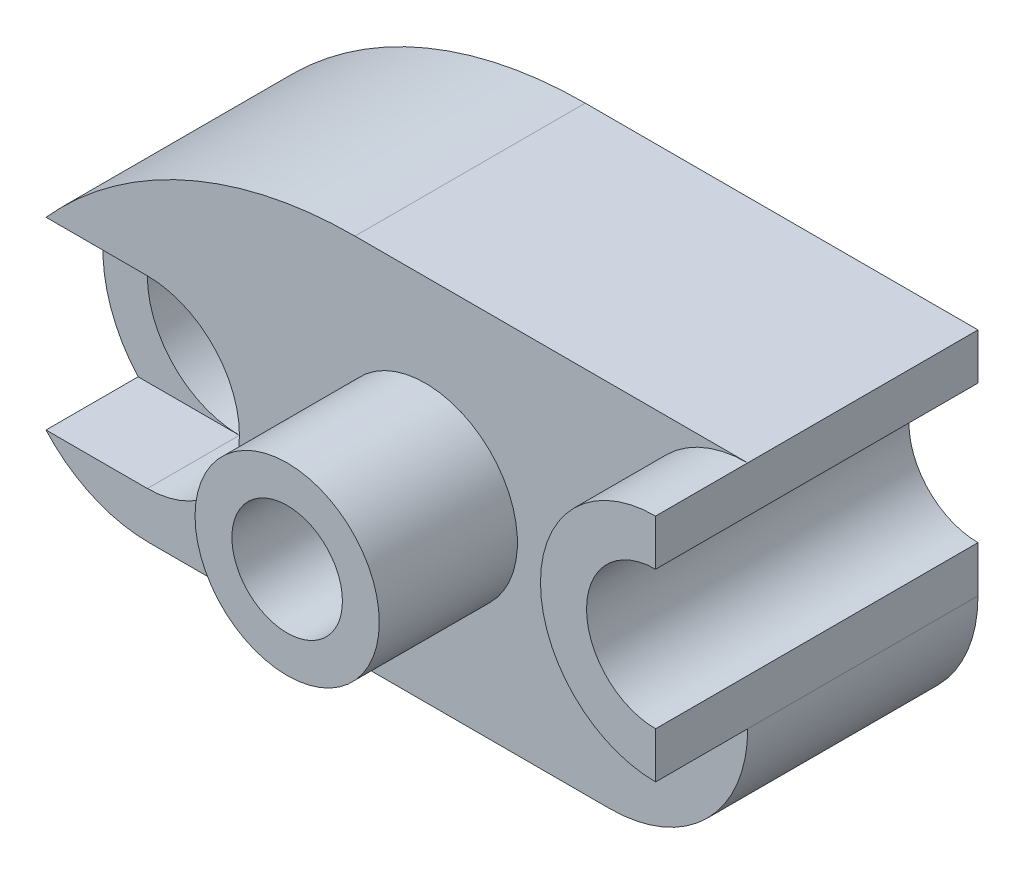
ISO-10303-21;
HEADER;
FILE_DESCRIPTION(('STEP AP214'),'2;1');
FILE_NAME('part.step','',(''),(''),'','','');
FILE_SCHEMA(('AUTOMOTIVE_DESIGN { 1 0 10303 214 1 1 1 1 }'));
ENDSEC;
DATA;
#1=APPLICATION_CONTEXT('core data for automotive mechanical design processes');
#2=APPLICATION_PROTOCOL_DEFINITION('international standard','automotive_design',2000,#1);
#3=PRODUCT_CONTEXT('',#1,'mechanical');
#4=PRODUCT('Part','Part','',(#3));
#5=PRODUCT_RELATED_PRODUCT_CATEGORY('part','',(#4));
#6=PRODUCT_DEFINITION_FORMATION('','',#4);
#7=PRODUCT_DEFINITION_CONTEXT('part definition',#1,'design');
#8=PRODUCT_DEFINITION('design','',#6,#7);
#9=PRODUCT_DEFINITION_SHAPE('','',#8);
#10=(LENGTH_UNIT() NAMED_UNIT(*) SI_UNIT(.MILLI.,.METRE.));
#11=(NAMED_UNIT(*) PLANE_ANGLE_UNIT() SI_UNIT($,.RADIAN.));
#12=(NAMED_UNIT(*) SI_UNIT($,.STERADIAN.) SOLID_ANGLE_UNIT());
#13=UNCERTAINTY_MEASURE_WITH_UNIT(LENGTH_MEASURE(1.E-05),#10,'distance_accuracy_value','');
#14=(GEOMETRIC_REPRESENTATION_CONTEXT(3) GLOBAL_UNCERTAINTY_ASSIGNED_CONTEXT((#13)) GLOBAL_UNIT_ASSIGNED_CONTEXT((#10,
#11,#12)) REPRESENTATION_CONTEXT('',''));
#15=CARTESIAN_POINT('',(0.,0.,0.));
#16=DIRECTION('',(0.,0.,1.));
#17=DIRECTION('',(1.,0.,0.));
#18=AXIS2_PLACEMENT_3D('',#15,#16,#17);
#19=CARTESIAN_POINT('',(0.,0.,60.));
#20=DIRECTION('',(0.,0.,-1.));
#21=DIRECTION('',(-1.,0.,0.));
#22=AXIS2_PLACEMENT_3D('',#19,#20,#21);
#23=PLANE('',#22);
#24=CARTESIAN_POINT('',(90.,40.,60.));
#25=DIRECTION('',(0.,0.,-1.));
#26=DIRECTION('',(-1.,0.,0.));
#27=AXIS2_PLACEMENT_3D('',#24,#25,#26);
#28=CIRCLE('',#27,20.);
#29=CARTESIAN_POINT('',(70.,40.,60.));
#30=VERTEX_POINT('',#29);
#31=EDGE_CURVE('E12',#30,#30,#28,.F.);
#32=ORIENTED_EDGE('',*,*,#31,.F.);
#33=EDGE_LOOP('',(#32));
#34=FACE_BOUND('',#33,.T.);
#35=DIRECTION('',(-1.,0.,0.));
#36=VECTOR('',#35,1.);
#37=CARTESIAN_POINT('',(0.,50.,60.));
#38=LINE('',#37,#36);
#39=CARTESIAN_POINT('',(29.6393202250021,50.,60.));
#40=VERTEX_POINT('',#39);
#41=CARTESIAN_POINT('',(7.63932022500212,50.,60.));
#42=VERTEX_POINT('',#41);
#43=EDGE_CURVE('E177',#40,#42,#38,.T.);
#44=ORIENTED_EDGE('',*,*,#43,.F.);
#45=CARTESIAN_POINT('',(29.6393202250021,30.,60.));
#46=DIRECTION('',(0.,0.,1.));
#47=DIRECTION('',(1.,0.,0.));
#48=AXIS2_PLACEMENT_3D('',#45,#46,#47);
#49=CIRCLE('',#48,20.);
#50=CARTESIAN_POINT('',(29.6393202250021,10.,60.));
#51=VERTEX_POINT('',#50);
#52=EDGE_CURVE('E160',#51,#40,#49,.T.);
#53=ORIENTED_EDGE('',*,*,#52,.F.);
#54=DIRECTION('',(-1.,0.,0.));
#55=VECTOR('',#54,1.);
#56=CARTESIAN_POINT('',(0.,10.,60.));
#57=LINE('',#56,#55);
#58=CARTESIAN_POINT('',(7.6393202250021,10.,60.));
#59=VERTEX_POINT('',#58);
#60=EDGE_CURVE('E184',#51,#59,#57,.T.);
#61=ORIENTED_EDGE('',*,*,#60,.T.);
#62=CARTESIAN_POINT('',(30.,30.,60.));
#63=DIRECTION('',(0.,0.,-1.));
#64=DIRECTION('',(-1.,0.,0.));
#65=AXIS2_PLACEMENT_3D('',#62,#63,#64);
#66=CIRCLE('',#65,30.);
#67=CARTESIAN_POINT('',(30.,0.,60.));
#68=VERTEX_POINT('',#67);
#69=EDGE_CURVE('E223',#68,#59,#66,.T.);
#70=ORIENTED_EDGE('',*,*,#69,.F.);
#71=DIRECTION('',(1.,0.,0.));
#72=VECTOR('',#71,1.);
#73=CARTESIAN_POINT('',(160.,0.,60.));
#74=LINE('',#73,#72);
#75=CARTESIAN_POINT('',(130.,0.,60.));
#76=VERTEX_POINT('',#75);
#77=EDGE_CURVE('E221',#68,#76,#74,.T.);
#78=ORIENTED_EDGE('',*,*,#77,.T.);
#79=CARTESIAN_POINT('',(130.,30.,60.));
#80=DIRECTION('',(0.,0.,-1.));
#81=DIRECTION('',(-1.,0.,0.));
#82=AXIS2_PLACEMENT_3D('',#79,#80,#81);
#83=CIRCLE('',#82,30.);
#84=CARTESIAN_POINT('',(160.,30.,60.));
#85=VERTEX_POINT('',#84);
#86=EDGE_CURVE('E226',#85,#76,#83,.T.);
#87=ORIENTED_EDGE('',*,*,#86,.F.);
#88=CARTESIAN_POINT('',(160.,55.,60.));
#89=DIRECTION('',(0.,0.,1.));
#90=DIRECTION('',(1.,0.,0.));
#91=AXIS2_PLACEMENT_3D('',#88,#89,#90);
#92=CIRCLE('',#91,25.);
#93=CARTESIAN_POINT('',(160.,80.,60.));
#94=VERTEX_POINT('',#93);
#95=EDGE_CURVE('E194',#94,#85,#92,.T.);
#96=ORIENTED_EDGE('',*,*,#95,.F.);
#97=DIRECTION('',(-1.,0.,0.));
#98=VECTOR('',#97,1.);
#99=CARTESIAN_POINT('',(160.,80.,60.));
#100=LINE('',#99,#98);
#101=CARTESIAN_POINT('',(74.7213595499958,80.,60.));
#102=VERTEX_POINT('',#101);
#103=EDGE_CURVE('E81',#94,#102,#100,.T.);
#104=ORIENTED_EDGE('',*,*,#103,.T.);
#105=CARTESIAN_POINT('',(74.7213595499958,-10.,60.));
#106=DIRECTION('',(0.,0.,-1.));
#107=DIRECTION('',(-1.,0.,0.));
#108=AXIS2_PLACEMENT_3D('',#105,#106,#107);
#109=CIRCLE('',#108,90.);
#110=EDGE_CURVE('E74',#42,#102,#109,.T.);
#111=ORIENTED_EDGE('',*,*,#110,.F.);
#112=EDGE_LOOP('',(#44,#53,#61,#70,#78,#87,#96,#104,#111));
#113=FACE_BOUND('',#112,.T.);
#114=ADVANCED_FACE('F66',(#34,#113),#23,.F.);
#115=CARTESIAN_POINT('',(30.,30.,0.));
#116=DIRECTION('',(0.,0.,1.));
#117=DIRECTION('',(1.,0.,0.));
#118=AXIS2_PLACEMENT_3D('',#115,#116,#117);
#119=CYLINDRICAL_SURFACE('',#118,30.);
#120=DIRECTION('',(0.,0.,1.));
#121=VECTOR('',#120,1.);
#122=CARTESIAN_POINT('',(7.6393202250021,10.,40.));
#123=LINE('',#122,#121);
#124=CARTESIAN_POINT('',(7.6393202250021,10.,40.));
#125=VERTEX_POINT('',#124);
#126=EDGE_CURVE('E195',#125,#59,#123,.T.);
#127=ORIENTED_EDGE('',*,*,#126,.F.);
#128=CARTESIAN_POINT('',(30.,30.,40.));
#129=DIRECTION('',(0.,0.,1.));
#130=DIRECTION('',(1.,0.,0.));
#131=AXIS2_PLACEMENT_3D('',#128,#129,#130);
#132=CIRCLE('',#131,30.);
#133=CARTESIAN_POINT('',(7.63932022500211,50.,40.));
#134=VERTEX_POINT('',#133);
#135=EDGE_CURVE('E310',#134,#125,#132,.T.);
#136=ORIENTED_EDGE('',*,*,#135,.F.);
#137=DIRECTION('',(0.,0.,1.));
#138=VECTOR('',#137,1.);
#139=CARTESIAN_POINT('',(7.63932022500212,50.,-173.));
#140=LINE('',#139,#138);
#141=CARTESIAN_POINT('',(7.63932022500212,50.,9.99999999999987));
#142=VERTEX_POINT('',#141);
#143=EDGE_CURVE('E229',#142,#134,#140,.T.);
#144=ORIENTED_EDGE('',*,*,#143,.F.);
#145=CARTESIAN_POINT('',(30.,30.,10.));
#146=DIRECTION('',(0.,0.,-1.));
#147=DIRECTION('',(-1.,0.,0.));
#148=AXIS2_PLACEMENT_3D('',#145,#146,#147);
#149=CIRCLE('',#148,30.);
#150=CARTESIAN_POINT('',(30.,0.,10.));
#151=VERTEX_POINT('',#150);
#152=EDGE_CURVE('E270',#151,#142,#149,.T.);
#153=ORIENTED_EDGE('',*,*,#152,.F.);
#154=DIRECTION('',(0.,0.,1.));
#155=VECTOR('',#154,1.);
#156=CARTESIAN_POINT('',(30.,0.,0.));
#157=LINE('',#156,#155);
#158=EDGE_CURVE('E252',#151,#68,#157,.T.);
#159=ORIENTED_EDGE('',*,*,#158,.T.);
#160=ORIENTED_EDGE('',*,*,#69,.T.);
#161=EDGE_LOOP('',(#127,#136,#144,#153,#159,#160));
#162=FACE_BOUND('',#161,.T.);
#163=ADVANCED_FACE('F306',(#162),#119,.T.);
#164=CARTESIAN_POINT('',(0.,80.,90.));
#165=DIRECTION('',(0.,-1.,0.));
#166=DIRECTION('',(0.,0.,-1.));
#167=AXIS2_PLACEMENT_3D('',#164,#165,#166);
#168=PLANE('',#167);
#169=DIRECTION('',(0.,0.,1.));
#170=VECTOR('',#169,1.);
#171=CARTESIAN_POINT('',(74.7213595499958,80.,-173.));
#172=LINE('',#171,#170);
#173=CARTESIAN_POINT('',(74.7213595499958,80.,10.));
#174=VERTEX_POINT('',#173);
#175=EDGE_CURVE('E88',#174,#102,#172,.T.);
#176=ORIENTED_EDGE('',*,*,#175,.T.);
#177=ORIENTED_EDGE('',*,*,#103,.F.);
#178=DIRECTION('',(0.,0.,-1.));
#179=VECTOR('',#178,1.);
#180=CARTESIAN_POINT('',(160.,80.,90.));
#181=LINE('',#180,#179);
#182=CARTESIAN_POINT('',(160.,80.,10.));
#183=VERTEX_POINT('',#182);
#184=EDGE_CURVE('E264',#94,#183,#181,.T.);
#185=ORIENTED_EDGE('',*,*,#184,.T.);
#186=DIRECTION('',(-1.,0.,0.));
#187=VECTOR('',#186,1.);
#188=CARTESIAN_POINT('',(215.,80.,10.));
#189=LINE('',#188,#187);
#190=EDGE_CURVE('E246',#183,#174,#189,.T.);
#191=ORIENTED_EDGE('',*,*,#190,.T.);
#192=EDGE_LOOP('',(#176,#177,#185,#191));
#193=FACE_BOUND('',#192,.T.);
#194=ADVANCED_FACE('F275',(#193),#168,.F.);
#195=CARTESIAN_POINT('',(0.,0.,0.));
#196=DIRECTION('',(0.,0.,-1.));
#197=DIRECTION('',(-1.,0.,0.));
#198=AXIS2_PLACEMENT_3D('',#195,#196,#197);
#199=PLANE('',#198);
#200=CARTESIAN_POINT('',(90.,40.,0.));
#201=DIRECTION('',(0.,0.,-1.));
#202=DIRECTION('',(-1.,0.,0.));
#203=AXIS2_PLACEMENT_3D('',#200,#201,#202);
#204=CIRCLE('',#203,12.);
#205=CARTESIAN_POINT('',(78.,40.,0.));
#206=VERTEX_POINT('',#205);
#207=EDGE_CURVE('E321',#206,#206,#204,.T.);
#208=ORIENTED_EDGE('',*,*,#207,.F.);
#209=EDGE_LOOP('',(#208));
#210=FACE_BOUND('',#209,.T.);
#211=CARTESIAN_POINT('',(90.,40.,0.));
#212=DIRECTION('',(0.,0.,-1.));
#213=DIRECTION('',(-1.,0.,0.));
#214=AXIS2_PLACEMENT_3D('',#211,#212,#213);
#215=CIRCLE('',#214,25.);
#216=CARTESIAN_POINT('',(65.,40.,0.));
#217=VERTEX_POINT('',#216);
#218=EDGE_CURVE('E231',#217,#217,#215,.T.);
#219=ORIENTED_EDGE('',*,*,#218,.T.);
#220=EDGE_LOOP('',(#219));
#221=FACE_BOUND('',#220,.T.);
#222=ADVANCED_FACE('F361',(#210,#221),#199,.T.);
#223=CARTESIAN_POINT('',(130.,30.,0.));
#224=DIRECTION('',(0.,0.,1.));
#225=DIRECTION('',(1.,0.,0.));
#226=AXIS2_PLACEMENT_3D('',#223,#224,#225);
#227=CYLINDRICAL_SURFACE('',#226,30.);
#228=DIRECTION('',(0.,0.,1.));
#229=VECTOR('',#228,1.);
#230=CARTESIAN_POINT('',(160.,30.,0.));
#231=LINE('',#230,#229);
#232=CARTESIAN_POINT('',(160.,30.,10.));
#233=VERTEX_POINT('',#232);
#234=EDGE_CURVE('E255',#233,#85,#231,.T.);
#235=ORIENTED_EDGE('',*,*,#234,.T.);
#236=ORIENTED_EDGE('',*,*,#86,.T.);
#237=DIRECTION('',(0.,0.,1.));
#238=VECTOR('',#237,1.);
#239=CARTESIAN_POINT('',(130.,0.,0.));
#240=LINE('',#239,#238);
#241=CARTESIAN_POINT('',(130.,0.,10.));
#242=VERTEX_POINT('',#241);
#243=EDGE_CURVE('E256',#242,#76,#240,.T.);
#244=ORIENTED_EDGE('',*,*,#243,.F.);
#245=CARTESIAN_POINT('',(130.,30.,10.));
#246=DIRECTION('',(0.,0.,-1.));
#247=DIRECTION('',(-1.,0.,0.));
#248=AXIS2_PLACEMENT_3D('',#245,#246,#247);
#249=CIRCLE('',#248,30.);
#250=EDGE_CURVE('E244',#233,#242,#249,.T.);
#251=ORIENTED_EDGE('',*,*,#250,.F.);
#252=EDGE_LOOP('',(#235,#236,#244,#251));
#253=FACE_BOUND('',#252,.T.);
#254=ADVANCED_FACE('F303',(#253),#227,.T.);
#255=CARTESIAN_POINT('',(160.,0.,90.));
#256=DIRECTION('',(-1.,0.,0.));
#257=DIRECTION('',(0.,0.,1.));
#258=AXIS2_PLACEMENT_3D('',#255,#256,#257);
#259=PLANE('',#258);
#260=DIRECTION('',(0.,0.,1.));
#261=VECTOR('',#260,1.);
#262=CARTESIAN_POINT('',(160.,40.,0.));
#263=LINE('',#262,#261);
#264=CARTESIAN_POINT('',(160.,40.,10.));
#265=VERTEX_POINT('',#264);
#266=CARTESIAN_POINT('',(160.,40.,80.));
#267=VERTEX_POINT('',#266);
#268=EDGE_CURVE('E262',#265,#267,#263,.T.);
#269=ORIENTED_EDGE('',*,*,#268,.T.);
#270=DIRECTION('',(0.,1.,0.));
#271=VECTOR('',#270,1.);
#272=CARTESIAN_POINT('',(160.,40.,80.));
#273=LINE('',#272,#271);
#274=CARTESIAN_POINT('',(160.,30.,80.));
#275=VERTEX_POINT('',#274);
#276=EDGE_CURVE('E201',#275,#267,#273,.T.);
#277=ORIENTED_EDGE('',*,*,#276,.F.);
#278=DIRECTION('',(0.,0.,-1.));
#279=VECTOR('',#278,1.);
#280=CARTESIAN_POINT('',(160.,30.,80.));
#281=LINE('',#280,#279);
#282=EDGE_CURVE('E214',#275,#85,#281,.T.);
#283=ORIENTED_EDGE('',*,*,#282,.T.);
#284=ORIENTED_EDGE('',*,*,#234,.F.);
#285=DIRECTION('',(0.,-1.,0.));
#286=VECTOR('',#285,1.);
#287=CARTESIAN_POINT('',(160.,0.,10.));
#288=LINE('',#287,#286);
#289=EDGE_CURVE('E237',#265,#233,#288,.T.);
#290=ORIENTED_EDGE('',*,*,#289,.F.);
#291=EDGE_LOOP('',(#269,#277,#283,#284,#290));
#292=FACE_BOUND('',#291,.T.);
#293=ADVANCED_FACE('F293',(#292),#259,.F.);
#294=CARTESIAN_POINT('',(160.,55.,0.));
#295=DIRECTION('',(0.,0.,1.));
#296=DIRECTION('',(1.,0.,0.));
#297=AXIS2_PLACEMENT_3D('',#294,#295,#296);
#298=CYLINDRICAL_SURFACE('',#297,15.);
#299=DIRECTION('',(0.,0.,1.));
#300=VECTOR('',#299,1.);
#301=CARTESIAN_POINT('',(160.,70.,0.));
#302=LINE('',#301,#300);
#303=CARTESIAN_POINT('',(160.,70.,9.99999999999998));
#304=VERTEX_POINT('',#303);
#305=CARTESIAN_POINT('',(160.,70.,80.));
#306=VERTEX_POINT('',#305);
#307=EDGE_CURVE('E259',#304,#306,#302,.T.);
#308=ORIENTED_EDGE('',*,*,#307,.T.);
#309=CARTESIAN_POINT('',(160.,55.,80.));
#310=DIRECTION('',(0.,0.,-1.));
#311=DIRECTION('',(1.,0.,0.));
#312=AXIS2_PLACEMENT_3D('',#309,#310,#311);
#313=CIRCLE('',#312,15.);
#314=EDGE_CURVE('E204',#267,#306,#313,.T.);
#315=ORIENTED_EDGE('',*,*,#314,.F.);
#316=ORIENTED_EDGE('',*,*,#268,.F.);
#317=CARTESIAN_POINT('',(160.,55.,9.99999999999999));
#318=DIRECTION('',(0.,0.,1.));
#319=DIRECTION('',(0.,-1.,0.));
#320=AXIS2_PLACEMENT_3D('',#317,#318,#319);
#321=CIRCLE('',#320,15.);
#322=EDGE_CURVE('E267',#265,#304,#321,.F.);
#323=ORIENTED_EDGE('',*,*,#322,.T.);
#324=EDGE_LOOP('',(#308,#315,#316,#323));
#325=FACE_BOUND('',#324,.T.);
#326=ADVANCED_FACE('F286',(#325),#298,.F.);
#327=CARTESIAN_POINT('',(0.,0.,90.));
#328=DIRECTION('',(0.,1.,0.));
#329=DIRECTION('',(0.,0.,1.));
#330=AXIS2_PLACEMENT_3D('',#327,#328,#329);
#331=PLANE('',#330);
#332=ORIENTED_EDGE('',*,*,#243,.T.);
#333=ORIENTED_EDGE('',*,*,#77,.F.);
#334=ORIENTED_EDGE('',*,*,#158,.F.);
#335=DIRECTION('',(-1.,0.,0.));
#336=VECTOR('',#335,1.);
#337=CARTESIAN_POINT('',(215.,0.,10.));
#338=LINE('',#337,#336);
#339=EDGE_CURVE('E240',#242,#151,#338,.T.);
#340=ORIENTED_EDGE('',*,*,#339,.F.);
#341=EDGE_LOOP('',(#332,#333,#334,#340));
#342=FACE_BOUND('',#341,.T.);
#343=ADVANCED_FACE('F68',(#342),#331,.F.);
#344=ORIENTED_EDGE('',*,*,#184,.F.);
#345=DIRECTION('',(0.,0.,-1.));
#346=VECTOR('',#345,1.);
#347=CARTESIAN_POINT('',(160.,80.,80.));
#348=LINE('',#347,#346);
#349=CARTESIAN_POINT('',(160.,80.,80.));
#350=VERTEX_POINT('',#349);
#351=EDGE_CURVE('E209',#350,#94,#348,.T.);
#352=ORIENTED_EDGE('',*,*,#351,.F.);
#353=DIRECTION('',(0.,1.,0.));
#354=VECTOR('',#353,1.);
#355=CARTESIAN_POINT('',(160.,70.,80.));
#356=LINE('',#355,#354);
#357=EDGE_CURVE('E207',#306,#350,#356,.T.);
#358=ORIENTED_EDGE('',*,*,#357,.F.);
#359=ORIENTED_EDGE('',*,*,#307,.F.);
#360=DIRECTION('',(0.,1.,0.));
#361=VECTOR('',#360,1.);
#362=CARTESIAN_POINT('',(160.,0.,9.99999999999995));
#363=LINE('',#362,#361);
#364=EDGE_CURVE('E249',#304,#183,#363,.T.);
#365=ORIENTED_EDGE('',*,*,#364,.T.);
#366=EDGE_LOOP('',(#344,#352,#358,#359,#365));
#367=FACE_BOUND('',#366,.T.);
#368=ADVANCED_FACE('F281',(#367),#259,.F.);
#369=CARTESIAN_POINT('',(215.,0.,9.99999999999995));
#370=DIRECTION('',(0.,0.,1.));
#371=DIRECTION('',(0.,-1.,0.));
#372=AXIS2_PLACEMENT_3D('',#369,#370,#371);
#373=PLANE('',#372);
#374=CARTESIAN_POINT('',(29.6393202250021,30.,9.99999999999997));
#375=DIRECTION('',(0.,0.,1.));
#376=DIRECTION('',(0.,-1.,0.));
#377=AXIS2_PLACEMENT_3D('',#374,#375,#376);
#378=CIRCLE('',#377,9.99999999999999);
#379=CARTESIAN_POINT('',(29.6393202250021,20.,9.99999999999996));
#380=VERTEX_POINT('',#379);
#381=EDGE_CURVE('E172',#380,#380,#378,.T.);
#382=ORIENTED_EDGE('',*,*,#381,.T.);
#383=EDGE_LOOP('',(#382));
#384=FACE_BOUND('',#383,.T.);
#385=CARTESIAN_POINT('',(90.,40.,10.));
#386=DIRECTION('',(0.,0.,-1.));
#387=DIRECTION('',(-1.,0.,0.));
#388=AXIS2_PLACEMENT_3D('',#385,#386,#387);
#389=CIRCLE('',#388,25.);
#390=CARTESIAN_POINT('',(65.,40.,10.));
#391=VERTEX_POINT('',#390);
#392=EDGE_CURVE('E234',#391,#391,#389,.T.);
#393=ORIENTED_EDGE('',*,*,#392,.F.);
#394=EDGE_LOOP('',(#393));
#395=FACE_BOUND('',#394,.T.);
#396=ORIENTED_EDGE('',*,*,#152,.T.);
#397=CARTESIAN_POINT('',(74.7213595499958,-10.,9.99999999999995));
#398=DIRECTION('',(0.,0.,1.));
#399=DIRECTION('',(0.,-1.,0.));
#400=AXIS2_PLACEMENT_3D('',#397,#398,#399);
#401=CIRCLE('',#400,90.);
#402=EDGE_CURVE('E272',#142,#174,#401,.F.);
#403=ORIENTED_EDGE('',*,*,#402,.T.);
#404=ORIENTED_EDGE('',*,*,#190,.F.);
#405=ORIENTED_EDGE('',*,*,#364,.F.);
#406=ORIENTED_EDGE('',*,*,#322,.F.);
#407=ORIENTED_EDGE('',*,*,#289,.T.);
#408=ORIENTED_EDGE('',*,*,#250,.T.);
#409=ORIENTED_EDGE('',*,*,#339,.T.);
#410=EDGE_LOOP('',(#396,#403,#404,#405,#406,#407,#408,#409));
#411=FACE_BOUND('',#410,.T.);
#412=ADVANCED_FACE('F278',(#384,#395,#411),#373,.F.);
#413=CARTESIAN_POINT('',(90.,40.,10.));
#414=DIRECTION('',(0.,0.,-1.));
#415=DIRECTION('',(-1.,0.,0.));
#416=AXIS2_PLACEMENT_3D('',#413,#414,#415);
#417=CYLINDRICAL_SURFACE('',#416,25.);
#418=ORIENTED_EDGE('',*,*,#218,.F.);
#419=EDGE_LOOP('',(#418));
#420=FACE_BOUND('',#419,.T.);
#421=ORIENTED_EDGE('',*,*,#392,.T.);
#422=EDGE_LOOP('',(#421));
#423=FACE_BOUND('',#422,.T.);
#424=ADVANCED_FACE('F352',(#420,#423),#417,.T.);
#425=CARTESIAN_POINT('',(74.7213595499958,-10.,-173.));
#426=DIRECTION('',(0.,0.,1.));
#427=DIRECTION('',(1.,0.,0.));
#428=AXIS2_PLACEMENT_3D('',#425,#426,#427);
#429=CYLINDRICAL_SURFACE('',#428,90.);
#430=ORIENTED_EDGE('',*,*,#143,.T.);
#431=DIRECTION('',(0.,0.,1.));
#432=VECTOR('',#431,1.);
#433=CARTESIAN_POINT('',(7.63932022500211,50.,40.));
#434=LINE('',#433,#432);
#435=EDGE_CURVE('E181',#134,#42,#434,.T.);
#436=ORIENTED_EDGE('',*,*,#435,.T.);
#437=ORIENTED_EDGE('',*,*,#110,.T.);
#438=ORIENTED_EDGE('',*,*,#175,.F.);
#439=ORIENTED_EDGE('',*,*,#402,.F.);
#440=EDGE_LOOP('',(#430,#436,#437,#438,#439));
#441=FACE_BOUND('',#440,.T.);
#442=ADVANCED_FACE('F273',(#441),#429,.T.);
#443=CARTESIAN_POINT('',(90.,40.,90.));
#444=DIRECTION('',(0.,0.,-1.));
#445=DIRECTION('',(-1.,0.,0.));
#446=AXIS2_PLACEMENT_3D('',#443,#444,#445);
#447=CYLINDRICAL_SURFACE('',#446,20.);
#448=CARTESIAN_POINT('',(90.,40.,90.));
#449=DIRECTION('',(0.,0.,1.));
#450=DIRECTION('',(1.,0.,0.));
#451=AXIS2_PLACEMENT_3D('',#448,#449,#450);
#452=CIRCLE('',#451,20.);
#453=CARTESIAN_POINT('',(110.,40.,90.));
#454=VERTEX_POINT('',#453);
#455=EDGE_CURVE('E217',#454,#454,#452,.T.);
#456=ORIENTED_EDGE('',*,*,#455,.F.);
#457=EDGE_LOOP('',(#456));
#458=FACE_BOUND('',#457,.T.);
#459=ORIENTED_EDGE('',*,*,#31,.T.);
#460=EDGE_LOOP('',(#459));
#461=FACE_BOUND('',#460,.T.);
#462=ADVANCED_FACE('F334',(#458,#461),#447,.T.);
#463=CARTESIAN_POINT('',(90.,40.,90.));
#464=DIRECTION('',(0.,0.,1.));
#465=DIRECTION('',(1.,0.,0.));
#466=AXIS2_PLACEMENT_3D('',#463,#464,#465);
#467=PLANE('',#466);
#468=CARTESIAN_POINT('',(90.,40.,90.));
#469=DIRECTION('',(0.,0.,1.));
#470=DIRECTION('',(1.,0.,0.));
#471=AXIS2_PLACEMENT_3D('',#468,#469,#470);
#472=CIRCLE('',#471,12.);
#473=CARTESIAN_POINT('',(102.,40.,90.));
#474=VERTEX_POINT('',#473);
#475=EDGE_CURVE('E324',#474,#474,#472,.T.);
#476=ORIENTED_EDGE('',*,*,#475,.F.);
#477=EDGE_LOOP('',(#476));
#478=FACE_BOUND('',#477,.T.);
#479=ORIENTED_EDGE('',*,*,#455,.T.);
#480=EDGE_LOOP('',(#479));
#481=FACE_BOUND('',#480,.T.);
#482=ADVANCED_FACE('F330',(#478,#481),#467,.T.);
#483=CARTESIAN_POINT('',(160.,55.,80.));
#484=DIRECTION('',(0.,0.,-1.));
#485=DIRECTION('',(-1.,0.,0.));
#486=AXIS2_PLACEMENT_3D('',#483,#484,#485);
#487=CYLINDRICAL_SURFACE('',#486,25.);
#488=ORIENTED_EDGE('',*,*,#95,.T.);
#489=ORIENTED_EDGE('',*,*,#282,.F.);
#490=CARTESIAN_POINT('',(160.,55.,80.));
#491=DIRECTION('',(0.,0.,1.));
#492=DIRECTION('',(1.,0.,0.));
#493=AXIS2_PLACEMENT_3D('',#490,#491,#492);
#494=CIRCLE('',#493,25.);
#495=EDGE_CURVE('E198',#350,#275,#494,.T.);
#496=ORIENTED_EDGE('',*,*,#495,.F.);
#497=ORIENTED_EDGE('',*,*,#351,.T.);
#498=EDGE_LOOP('',(#488,#489,#496,#497));
#499=FACE_BOUND('',#498,.T.);
#500=ADVANCED_FACE('F333',(#499),#487,.T.);
#501=CARTESIAN_POINT('',(160.,55.,80.));
#502=DIRECTION('',(0.,0.,1.));
#503=DIRECTION('',(1.,0.,0.));
#504=AXIS2_PLACEMENT_3D('',#501,#502,#503);
#505=PLANE('',#504);
#506=ORIENTED_EDGE('',*,*,#495,.T.);
#507=ORIENTED_EDGE('',*,*,#276,.T.);
#508=ORIENTED_EDGE('',*,*,#314,.T.);
#509=ORIENTED_EDGE('',*,*,#357,.T.);
#510=EDGE_LOOP('',(#506,#507,#508,#509));
#511=FACE_BOUND('',#510,.T.);
#512=ADVANCED_FACE('F289',(#511),#505,.T.);
#513=CARTESIAN_POINT('',(0.,10.,40.));
#514=DIRECTION('',(0.,1.,0.));
#515=DIRECTION('',(-1.,0.,0.));
#516=AXIS2_PLACEMENT_3D('',#513,#514,#515);
#517=PLANE('',#516);
#518=ORIENTED_EDGE('',*,*,#60,.F.);
#519=DIRECTION('',(0.,0.,1.));
#520=VECTOR('',#519,1.);
#521=CARTESIAN_POINT('',(29.6393202250021,10.,40.));
#522=LINE('',#521,#520);
#523=CARTESIAN_POINT('',(29.6393202250021,10.,40.));
#524=VERTEX_POINT('',#523);
#525=EDGE_CURVE('E167',#524,#51,#522,.T.);
#526=ORIENTED_EDGE('',*,*,#525,.F.);
#527=DIRECTION('',(-1.,0.,0.));
#528=VECTOR('',#527,1.);
#529=CARTESIAN_POINT('',(0.,10.,40.));
#530=LINE('',#529,#528);
#531=EDGE_CURVE('E182',#524,#125,#530,.T.);
#532=ORIENTED_EDGE('',*,*,#531,.T.);
#533=ORIENTED_EDGE('',*,*,#126,.T.);
#534=EDGE_LOOP('',(#518,#526,#532,#533));
#535=FACE_BOUND('',#534,.T.);
#536=ADVANCED_FACE('F475',(#535),#517,.T.);
#537=CARTESIAN_POINT('',(0.,50.,40.));
#538=DIRECTION('',(0.,1.,0.));
#539=DIRECTION('',(-1.,0.,0.));
#540=AXIS2_PLACEMENT_3D('',#537,#538,#539);
#541=PLANE('',#540);
#542=ORIENTED_EDGE('',*,*,#43,.T.);
#543=ORIENTED_EDGE('',*,*,#435,.F.);
#544=DIRECTION('',(-1.,0.,0.));
#545=VECTOR('',#544,1.);
#546=CARTESIAN_POINT('',(0.,50.,40.));
#547=LINE('',#546,#545);
#548=CARTESIAN_POINT('',(29.6393202250021,50.,40.));
#549=VERTEX_POINT('',#548);
#550=EDGE_CURVE('E180',#549,#134,#547,.T.);
#551=ORIENTED_EDGE('',*,*,#550,.F.);
#552=DIRECTION('',(0.,0.,1.));
#553=VECTOR('',#552,1.);
#554=CARTESIAN_POINT('',(29.6393202250021,50.,40.));
#555=LINE('',#554,#553);
#556=EDGE_CURVE('E164',#549,#40,#555,.T.);
#557=ORIENTED_EDGE('',*,*,#556,.T.);
#558=EDGE_LOOP('',(#542,#543,#551,#557));
#559=FACE_BOUND('',#558,.T.);
#560=ADVANCED_FACE('F176',(#559),#541,.F.);
#561=CARTESIAN_POINT('',(0.,0.,40.));
#562=DIRECTION('',(0.,0.,1.));
#563=DIRECTION('',(1.,0.,0.));
#564=AXIS2_PLACEMENT_3D('',#561,#562,#563);
#565=PLANE('',#564);
#566=CARTESIAN_POINT('',(29.6393202250021,30.,40.));
#567=DIRECTION('',(0.,0.,1.));
#568=DIRECTION('',(1.,0.,0.));
#569=AXIS2_PLACEMENT_3D('',#566,#567,#568);
#570=CIRCLE('',#569,20.);
#571=EDGE_CURVE('E186',#549,#524,#570,.T.);
#572=ORIENTED_EDGE('',*,*,#571,.F.);
#573=ORIENTED_EDGE('',*,*,#550,.T.);
#574=ORIENTED_EDGE('',*,*,#135,.T.);
#575=ORIENTED_EDGE('',*,*,#531,.F.);
#576=EDGE_LOOP('',(#572,#573,#574,#575));
#577=FACE_BOUND('',#576,.T.);
#578=ADVANCED_FACE('F462',(#577),#565,.T.);
#579=CARTESIAN_POINT('',(29.6393202250021,30.,20.));
#580=DIRECTION('',(0.,0.,1.));
#581=DIRECTION('',(1.,0.,0.));
#582=AXIS2_PLACEMENT_3D('',#579,#580,#581);
#583=CYLINDRICAL_SURFACE('',#582,20.);
#584=ORIENTED_EDGE('',*,*,#525,.T.);
#585=ORIENTED_EDGE('',*,*,#52,.T.);
#586=ORIENTED_EDGE('',*,*,#556,.F.);
#587=ORIENTED_EDGE('',*,*,#571,.T.);
#588=EDGE_LOOP('',(#584,#585,#586,#587));
#589=FACE_BOUND('',#588,.T.);
#590=CARTESIAN_POINT('',(29.6393202250021,30.,20.));
#591=DIRECTION('',(0.,0.,1.));
#592=DIRECTION('',(1.,0.,0.));
#593=AXIS2_PLACEMENT_3D('',#590,#591,#592);
#594=CIRCLE('',#593,20.);
#595=CARTESIAN_POINT('',(49.6393202250021,30.,20.));
#596=VERTEX_POINT('',#595);
#597=EDGE_CURVE('E171',#596,#596,#594,.T.);
#598=ORIENTED_EDGE('',*,*,#597,.F.);
#599=EDGE_LOOP('',(#598));
#600=FACE_BOUND('',#599,.T.);
#601=ADVANCED_FACE('F162',(#589,#600),#583,.F.);
#602=CARTESIAN_POINT('',(29.6393202250021,30.,20.));
#603=DIRECTION('',(0.,0.,1.));
#604=DIRECTION('',(1.,0.,0.));
#605=AXIS2_PLACEMENT_3D('',#602,#603,#604);
#606=PLANE('',#605);
#607=CARTESIAN_POINT('',(29.6393202250021,30.,20.));
#608=DIRECTION('',(0.,0.,1.));
#609=DIRECTION('',(1.,0.,0.));
#610=AXIS2_PLACEMENT_3D('',#607,#608,#609);
#611=CIRCLE('',#610,9.99999999999999);
#612=CARTESIAN_POINT('',(39.6393202250021,30.,20.));
#613=VERTEX_POINT('',#612);
#614=EDGE_CURVE('E318',#613,#613,#611,.T.);
#615=ORIENTED_EDGE('',*,*,#614,.F.);
#616=EDGE_LOOP('',(#615));
#617=FACE_BOUND('',#616,.T.);
#618=ORIENTED_EDGE('',*,*,#597,.T.);
#619=EDGE_LOOP('',(#618));
#620=FACE_BOUND('',#619,.T.);
#621=ADVANCED_FACE('F450',(#617,#620),#606,.T.);
#622=CARTESIAN_POINT('',(29.6393202250021,30.,-20.));
#623=DIRECTION('',(0.,0.,1.));
#624=DIRECTION('',(1.,0.,0.));
#625=AXIS2_PLACEMENT_3D('',#622,#623,#624);
#626=CYLINDRICAL_SURFACE('',#625,9.99999999999999);
#627=ORIENTED_EDGE('',*,*,#614,.T.);
#628=EDGE_LOOP('',(#627));
#629=FACE_BOUND('',#628,.T.);
#630=ORIENTED_EDGE('',*,*,#381,.F.);
#631=EDGE_LOOP('',(#630));
#632=FACE_BOUND('',#631,.T.);
#633=ADVANCED_FACE('F429',(#629,#632),#626,.F.);
#634=CARTESIAN_POINT('',(90.,40.,-24.0000000000001));
#635=DIRECTION('',(0.,0.,1.));
#636=DIRECTION('',(1.,0.,0.));
#637=AXIS2_PLACEMENT_3D('',#634,#635,#636);
#638=CYLINDRICAL_SURFACE('',#637,12.);
#639=ORIENTED_EDGE('',*,*,#207,.T.);
#640=EDGE_LOOP('',(#639));
#641=FACE_BOUND('',#640,.T.);
#642=ORIENTED_EDGE('',*,*,#475,.T.);
#643=EDGE_LOOP('',(#642));
#644=FACE_BOUND('',#643,.T.);
#645=ADVANCED_FACE('F328',(#641,#644),#638,.F.);
#646=CLOSED_SHELL('',(#114,#163,#194,#222,#254,#293,#326,#343,#368,#412,#424,#442,#462,#482,
#500,#512,#536,#560,#578,#601,#621,#633,#645));
#647=MANIFOLD_SOLID_BREP('B2',#646);
#648=ADVANCED_BREP_SHAPE_REPRESENTATION('',(#18,#647),#14);
#649=SHAPE_DEFINITION_REPRESENTATION(#9,#648);
ENDSEC;
END-ISO-10303-21;
